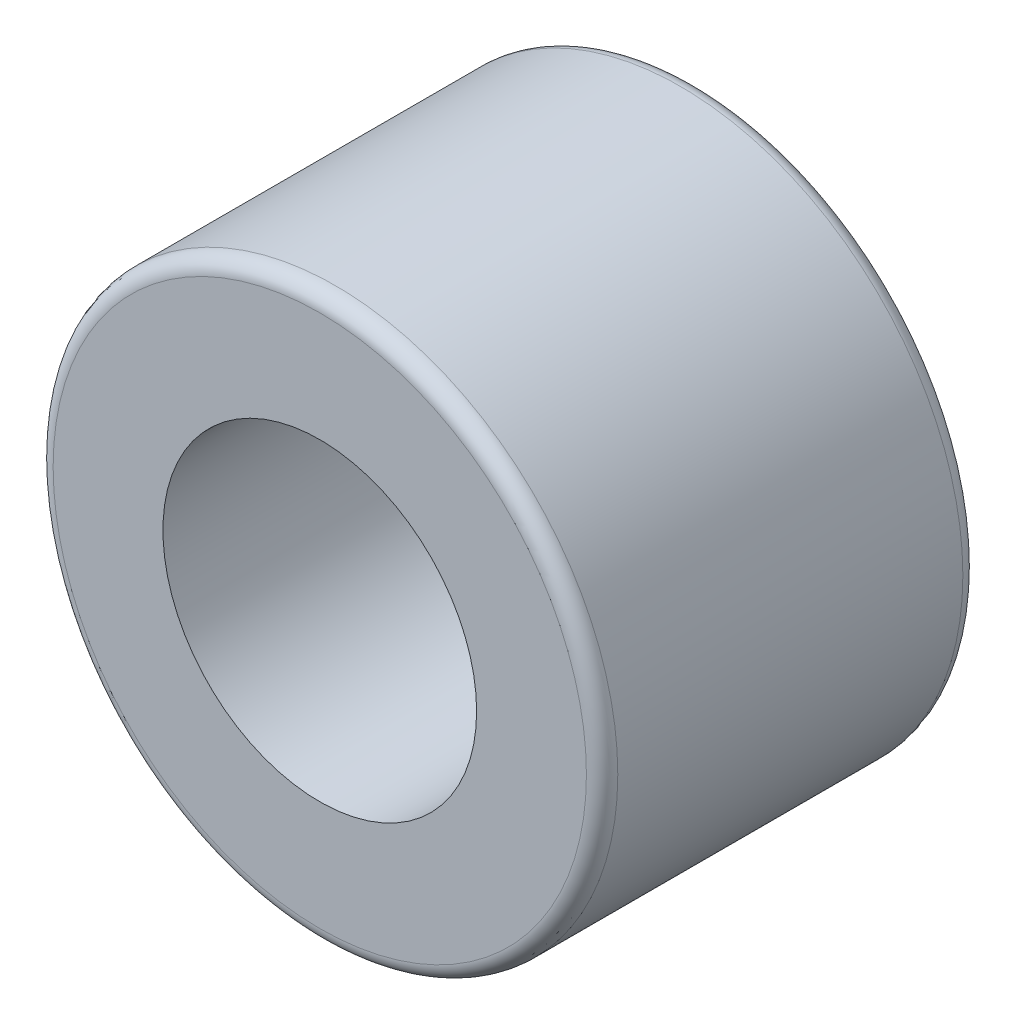
ISO-10303-21;
HEADER;
FILE_DESCRIPTION(('STEP AP214'),'2;1');
FILE_NAME('part.step','',(''),(''),'','','');
FILE_SCHEMA(('AUTOMOTIVE_DESIGN { 1 0 10303 214 1 1 1 1 }'));
ENDSEC;
DATA;
#1=APPLICATION_CONTEXT('core data for automotive mechanical design processes');
#2=APPLICATION_PROTOCOL_DEFINITION('international standard','automotive_design',2000,#1);
#3=PRODUCT_CONTEXT('',#1,'mechanical');
#4=PRODUCT('Part','Part','',(#3));
#5=PRODUCT_RELATED_PRODUCT_CATEGORY('part','',(#4));
#6=PRODUCT_DEFINITION_FORMATION('','',#4);
#7=PRODUCT_DEFINITION_CONTEXT('part definition',#1,'design');
#8=PRODUCT_DEFINITION('design','',#6,#7);
#9=PRODUCT_DEFINITION_SHAPE('','',#8);
#10=(LENGTH_UNIT() NAMED_UNIT(*) SI_UNIT(.MILLI.,.METRE.));
#11=(NAMED_UNIT(*) PLANE_ANGLE_UNIT() SI_UNIT($,.RADIAN.));
#12=(NAMED_UNIT(*) SI_UNIT($,.STERADIAN.) SOLID_ANGLE_UNIT());
#13=UNCERTAINTY_MEASURE_WITH_UNIT(LENGTH_MEASURE(1.E-05),#10,'distance_accuracy_value','');
#14=(GEOMETRIC_REPRESENTATION_CONTEXT(3) GLOBAL_UNCERTAINTY_ASSIGNED_CONTEXT((#13)) GLOBAL_UNIT_ASSIGNED_CONTEXT((#10,
#11,#12)) REPRESENTATION_CONTEXT('',''));
#15=CARTESIAN_POINT('',(0.,0.,0.));
#16=DIRECTION('',(0.,0.,1.));
#17=DIRECTION('',(1.,0.,0.));
#18=AXIS2_PLACEMENT_3D('',#15,#16,#17);
#19=CARTESIAN_POINT('',(0.,0.,9.52500000000001));
#20=DIRECTION('',(0.,0.,1.));
#21=DIRECTION('',(1.,0.,0.));
#22=AXIS2_PLACEMENT_3D('',#19,#20,#21);
#23=PLANE('',#22);
#24=CARTESIAN_POINT('',(0.,0.,9.52500000000001));
#25=DIRECTION('',(0.,0.,1.));
#26=DIRECTION('',(1.,0.,0.));
#27=AXIS2_PLACEMENT_3D('',#24,#25,#26);
#28=CIRCLE('',#27,13.49375);
#29=CARTESIAN_POINT('',(13.49375,0.,9.52500000000001));
#30=VERTEX_POINT('',#29);
#31=EDGE_CURVE('E10',#30,#30,#28,.T.);
#32=ORIENTED_EDGE('',*,*,#31,.T.);
#33=EDGE_LOOP('',(#32));
#34=FACE_BOUND('',#33,.T.);
#35=CARTESIAN_POINT('',(0.,0.,9.52500000000001));
#36=DIRECTION('',(0.,0.,1.));
#37=DIRECTION('',(1.,0.,0.));
#38=AXIS2_PLACEMENT_3D('',#35,#36,#37);
#39=CIRCLE('',#38,7.9375);
#40=CARTESIAN_POINT('',(7.93750000000001,0.,9.52500000000001));
#41=VERTEX_POINT('',#40);
#42=EDGE_CURVE('E54',#41,#41,#39,.T.);
#43=ORIENTED_EDGE('',*,*,#42,.F.);
#44=EDGE_LOOP('',(#43));
#45=FACE_BOUND('',#44,.T.);
#46=ADVANCED_FACE('F34',(#34,#45),#23,.T.);
#47=CARTESIAN_POINT('',(0.,0.,-9.52500000000001));
#48=DIRECTION('',(0.,0.,1.));
#49=DIRECTION('',(1.,0.,0.));
#50=AXIS2_PLACEMENT_3D('',#47,#48,#49);
#51=PLANE('',#50);
#52=CARTESIAN_POINT('',(0.,0.,-9.52500000000001));
#53=DIRECTION('',(0.,0.,1.));
#54=DIRECTION('',(1.,0.,0.));
#55=AXIS2_PLACEMENT_3D('',#52,#53,#54);
#56=CIRCLE('',#55,13.49375);
#57=CARTESIAN_POINT('',(13.49375,0.,-9.52500000000001));
#58=VERTEX_POINT('',#57);
#59=EDGE_CURVE('E41',#58,#58,#56,.F.);
#60=ORIENTED_EDGE('',*,*,#59,.T.);
#61=EDGE_LOOP('',(#60));
#62=FACE_BOUND('',#61,.T.);
#63=CARTESIAN_POINT('',(0.,0.,-9.52500000000001));
#64=DIRECTION('',(0.,0.,1.));
#65=DIRECTION('',(1.,0.,0.));
#66=AXIS2_PLACEMENT_3D('',#63,#64,#65);
#67=CIRCLE('',#66,7.9375);
#68=CARTESIAN_POINT('',(7.93750000000001,0.,-9.52500000000001));
#69=VERTEX_POINT('',#68);
#70=EDGE_CURVE('E55',#69,#69,#67,.T.);
#71=ORIENTED_EDGE('',*,*,#70,.T.);
#72=EDGE_LOOP('',(#71));
#73=FACE_BOUND('',#72,.T.);
#74=ADVANCED_FACE('F65',(#62,#73),#51,.F.);
#75=CARTESIAN_POINT('',(0.,0.,9.52500000000001));
#76=DIRECTION('',(0.,0.,-1.));
#77=DIRECTION('',(-1.,0.,0.));
#78=AXIS2_PLACEMENT_3D('',#75,#76,#77);
#79=CYLINDRICAL_SURFACE('',#78,14.2875);
#80=CARTESIAN_POINT('',(0.,0.,-8.73125));
#81=DIRECTION('',(0.,0.,1.));
#82=DIRECTION('',(1.,0.,0.));
#83=AXIS2_PLACEMENT_3D('',#80,#81,#82);
#84=CIRCLE('',#83,14.2875);
#85=CARTESIAN_POINT('',(14.2875,0.,-8.73125));
#86=VERTEX_POINT('',#85);
#87=EDGE_CURVE('E45',#86,#86,#84,.T.);
#88=ORIENTED_EDGE('',*,*,#87,.T.);
#89=EDGE_LOOP('',(#88));
#90=FACE_BOUND('',#89,.T.);
#91=CARTESIAN_POINT('',(0.,0.,8.73125));
#92=DIRECTION('',(0.,0.,1.));
#93=DIRECTION('',(1.,0.,0.));
#94=AXIS2_PLACEMENT_3D('',#91,#92,#93);
#95=CIRCLE('',#94,14.2875);
#96=CARTESIAN_POINT('',(14.2875,0.,8.73125));
#97=VERTEX_POINT('',#96);
#98=EDGE_CURVE('E49',#97,#97,#95,.F.);
#99=ORIENTED_EDGE('',*,*,#98,.T.);
#100=EDGE_LOOP('',(#99));
#101=FACE_BOUND('',#100,.T.);
#102=ADVANCED_FACE('F70',(#90,#101),#79,.T.);
#103=CARTESIAN_POINT('',(0.,0.,9.52500000000001));
#104=DIRECTION('',(0.,0.,-1.));
#105=DIRECTION('',(-1.,0.,0.));
#106=AXIS2_PLACEMENT_3D('',#103,#104,#105);
#107=CYLINDRICAL_SURFACE('',#106,7.9375);
#108=ORIENTED_EDGE('',*,*,#42,.T.);
#109=EDGE_LOOP('',(#108));
#110=FACE_BOUND('',#109,.T.);
#111=ORIENTED_EDGE('',*,*,#70,.F.);
#112=EDGE_LOOP('',(#111));
#113=FACE_BOUND('',#112,.T.);
#114=ADVANCED_FACE('F61',(#110,#113),#107,.F.);
#115=CARTESIAN_POINT('',(0.,0.,-8.73125));
#116=DIRECTION('',(0.,0.,1.));
#117=DIRECTION('',(1.,0.,0.));
#118=AXIS2_PLACEMENT_3D('',#115,#116,#117);
#119=TOROIDAL_SURFACE('',#118,13.49375,0.79375);
#120=ORIENTED_EDGE('',*,*,#59,.F.);
#121=EDGE_LOOP('',(#120));
#122=FACE_BOUND('',#121,.T.);
#123=ORIENTED_EDGE('',*,*,#87,.F.);
#124=EDGE_LOOP('',(#123));
#125=FACE_BOUND('',#124,.T.);
#126=ADVANCED_FACE('F76',(#122,#125),#119,.T.);
#127=CARTESIAN_POINT('',(0.,0.,8.73125));
#128=DIRECTION('',(0.,0.,1.));
#129=DIRECTION('',(1.,0.,0.));
#130=AXIS2_PLACEMENT_3D('',#127,#128,#129);
#131=TOROIDAL_SURFACE('',#130,13.49375,0.79375);
#132=ORIENTED_EDGE('',*,*,#98,.F.);
#133=EDGE_LOOP('',(#132));
#134=FACE_BOUND('',#133,.T.);
#135=ORIENTED_EDGE('',*,*,#31,.F.);
#136=EDGE_LOOP('',(#135));
#137=FACE_BOUND('',#136,.T.);
#138=ADVANCED_FACE('F36',(#134,#137),#131,.T.);
#139=CLOSED_SHELL('',(#46,#74,#102,#114,#126,#138));
#140=MANIFOLD_SOLID_BREP('B2',#139);
#141=ADVANCED_BREP_SHAPE_REPRESENTATION('',(#18,#140),#14);
#142=SHAPE_DEFINITION_REPRESENTATION(#9,#141);
ENDSEC;
END-ISO-10303-21;
